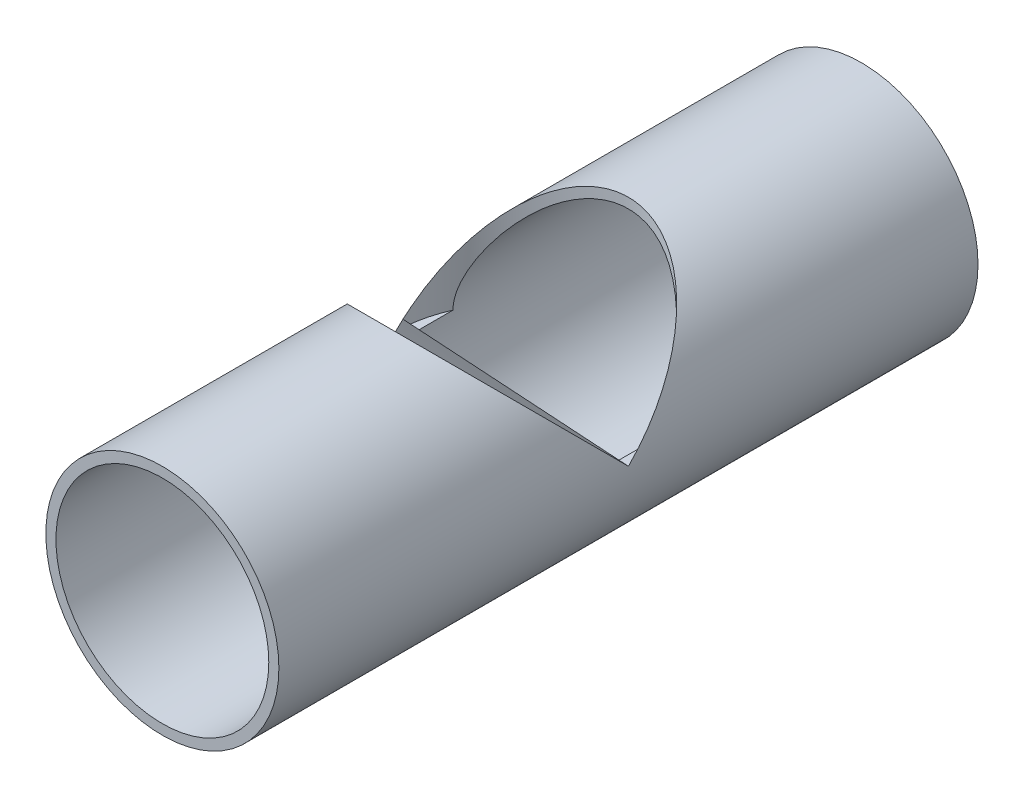
ISO-10303-21;
HEADER;
FILE_DESCRIPTION(('STEP AP214'),'2;1');
FILE_NAME('part.step','',(''),(''),'','','');
FILE_SCHEMA(('AUTOMOTIVE_DESIGN { 1 0 10303 214 1 1 1 1 }'));
ENDSEC;
DATA;
#1=APPLICATION_CONTEXT('core data for automotive mechanical design processes');
#2=APPLICATION_PROTOCOL_DEFINITION('international standard','automotive_design',2000,#1);
#3=PRODUCT_CONTEXT('',#1,'mechanical');
#4=PRODUCT('Part','Part','',(#3));
#5=PRODUCT_RELATED_PRODUCT_CATEGORY('part','',(#4));
#6=PRODUCT_DEFINITION_FORMATION('','',#4);
#7=PRODUCT_DEFINITION_CONTEXT('part definition',#1,'design');
#8=PRODUCT_DEFINITION('design','',#6,#7);
#9=PRODUCT_DEFINITION_SHAPE('','',#8);
#10=(LENGTH_UNIT() NAMED_UNIT(*) SI_UNIT(.MILLI.,.METRE.));
#11=(NAMED_UNIT(*) PLANE_ANGLE_UNIT() SI_UNIT($,.RADIAN.));
#12=(NAMED_UNIT(*) SI_UNIT($,.STERADIAN.) SOLID_ANGLE_UNIT());
#13=UNCERTAINTY_MEASURE_WITH_UNIT(LENGTH_MEASURE(1.E-05),#10,'distance_accuracy_value','');
#14=(GEOMETRIC_REPRESENTATION_CONTEXT(3) GLOBAL_UNCERTAINTY_ASSIGNED_CONTEXT((#13)) GLOBAL_UNIT_ASSIGNED_CONTEXT((#10,
#11,#12)) REPRESENTATION_CONTEXT('',''));
#15=CARTESIAN_POINT('',(0.,0.,0.));
#16=DIRECTION('',(0.,0.,1.));
#17=DIRECTION('',(1.,0.,0.));
#18=AXIS2_PLACEMENT_3D('',#15,#16,#17);
#19=CARTESIAN_POINT('',(0.,0.,57.15));
#20=DIRECTION('',(0.,-1.,0.));
#21=DIRECTION('',(0.,0.,-1.));
#22=AXIS2_PLACEMENT_3D('',#19,#20,#21);
#23=PLANE('',#22);
#24=CARTESIAN_POINT('',(0.,0.,57.15));
#25=DIRECTION('',(0.,1.,0.));
#26=DIRECTION('',(0.,0.,1.));
#27=AXIS2_PLACEMENT_3D('',#24,#25,#26);
#28=CIRCLE('',#27,19.05);
#29=CARTESIAN_POINT('',(-17.399,0.,49.3925971485297));
#30=VERTEX_POINT('',#29);
#31=CARTESIAN_POINT('',(-19.05,0.,57.15));
#32=VERTEX_POINT('',#31);
#33=EDGE_CURVE('E33',#30,#32,#28,.T.);
#34=ORIENTED_EDGE('',*,*,#33,.T.);
#35=CARTESIAN_POINT('',(0.,0.,57.15));
#36=DIRECTION('',(0.,1.,0.));
#37=DIRECTION('',(0.,0.,1.));
#38=AXIS2_PLACEMENT_3D('',#35,#36,#37);
#39=CIRCLE('',#38,19.05);
#40=CARTESIAN_POINT('',(-17.399,0.,64.9074028514703));
#41=VERTEX_POINT('',#40);
#42=EDGE_CURVE('E66',#32,#41,#39,.T.);
#43=ORIENTED_EDGE('',*,*,#42,.T.);
#44=DIRECTION('',(0.,0.,1.));
#45=VECTOR('',#44,1.);
#46=CARTESIAN_POINT('',(-17.399,0.,0.));
#47=LINE('',#46,#45);
#48=EDGE_CURVE('E58',#41,#30,#47,.F.);
#49=ORIENTED_EDGE('',*,*,#48,.T.);
#50=EDGE_LOOP('',(#34,#43,#49));
#51=FACE_BOUND('',#50,.T.);
#52=ADVANCED_FACE('F16',(#51),#23,.F.);
#53=CARTESIAN_POINT('',(0.,0.,57.15));
#54=DIRECTION('',(0.,-1.,0.));
#55=DIRECTION('',(0.,0.,-1.));
#56=AXIS2_PLACEMENT_3D('',#53,#54,#55);
#57=PLANE('',#56);
#58=CARTESIAN_POINT('',(0.,0.,57.15));
#59=DIRECTION('',(0.,1.,0.));
#60=DIRECTION('',(0.,0.,1.));
#61=AXIS2_PLACEMENT_3D('',#58,#59,#60);
#62=CIRCLE('',#61,19.05);
#63=CARTESIAN_POINT('',(17.399,0.,64.9074028514703));
#64=VERTEX_POINT('',#63);
#65=CARTESIAN_POINT('',(19.05,0.,57.15));
#66=VERTEX_POINT('',#65);
#67=EDGE_CURVE('E51',#64,#66,#62,.T.);
#68=ORIENTED_EDGE('',*,*,#67,.T.);
#69=CARTESIAN_POINT('',(0.,0.,57.15));
#70=DIRECTION('',(0.,1.,0.));
#71=DIRECTION('',(0.,0.,1.));
#72=AXIS2_PLACEMENT_3D('',#69,#70,#71);
#73=CIRCLE('',#72,19.05);
#74=CARTESIAN_POINT('',(17.399,0.,49.3925971485297));
#75=VERTEX_POINT('',#74);
#76=EDGE_CURVE('E54',#66,#75,#73,.T.);
#77=ORIENTED_EDGE('',*,*,#76,.T.);
#78=DIRECTION('',(0.,0.,1.));
#79=VECTOR('',#78,1.);
#80=CARTESIAN_POINT('',(17.399,0.,0.));
#81=LINE('',#80,#79);
#82=EDGE_CURVE('E47',#75,#64,#81,.T.);
#83=ORIENTED_EDGE('',*,*,#82,.T.);
#84=EDGE_LOOP('',(#68,#77,#83));
#85=FACE_BOUND('',#84,.T.);
#86=ADVANCED_FACE('F49',(#85),#57,.F.);
#87=CARTESIAN_POINT('',(0.,0.,0.));
#88=DIRECTION('',(0.,0.,1.));
#89=DIRECTION('',(1.,0.,0.));
#90=AXIS2_PLACEMENT_3D('',#87,#88,#89);
#91=CYLINDRICAL_SURFACE('',#90,17.399);
#92=CARTESIAN_POINT('',(0.,0.,0.));
#93=DIRECTION('',(0.,0.,1.));
#94=DIRECTION('',(1.,0.,0.));
#95=AXIS2_PLACEMENT_3D('',#92,#93,#94);
#96=CIRCLE('',#95,17.399);
#97=CARTESIAN_POINT('',(17.399,0.,0.));
#98=VERTEX_POINT('',#97);
#99=EDGE_CURVE('E114',#98,#98,#96,.T.);
#100=ORIENTED_EDGE('',*,*,#99,.F.);
#101=EDGE_LOOP('',(#100));
#102=FACE_BOUND('',#101,.T.);
#103=ORIENTED_EDGE('',*,*,#48,.F.);
#104=CARTESIAN_POINT('',(-17.399,0.,64.9074028514703));
#105=CARTESIAN_POINT('',(-17.3990027926557,0.126619411653412,64.9073892806763));
#106=CARTESIAN_POINT('',(-17.3976172953479,0.253213422142252,64.91050481767));
#107=CARTESIAN_POINT('',(-17.3920993093259,0.506011561056938,64.9228663106787));
#108=CARTESIAN_POINT('',(-17.3879674951789,0.632215777580591,64.9321107612707));
#109=CARTESIAN_POINT('',(-17.3715310393773,1.00902330778525,64.9687698671014));
#110=CARTESIAN_POINT('',(-17.3551849725285,1.25863541656879,65.005111937121));
#111=CARTESIAN_POINT('',(-17.3126787054344,1.74803233786395,65.0983443626753));
#112=CARTESIAN_POINT('',(-17.2867118539878,1.98791378893045,65.1548291232535));
#113=CARTESIAN_POINT('',(-17.2256220476168,2.4617617860572,65.2854561488629));
#114=CARTESIAN_POINT('',(-17.1904915826852,2.69572330712606,65.3596128925784));
#115=CARTESIAN_POINT('',(-17.0914704002142,3.27608545997221,65.5644416491115));
#116=CARTESIAN_POINT('',(-17.0220928683165,3.6182148201961,65.7045314532728));
#117=CARTESIAN_POINT('',(-16.8659507450822,4.2875618159471,66.008409139202));
#118=CARTESIAN_POINT('',(-16.7791763237468,4.6147708919803,66.1722104043654));
#119=CARTESIAN_POINT('',(-16.5885907607409,5.25908025866418,66.5180621575718));
#120=CARTESIAN_POINT('',(-16.4846028375362,5.57602990071133,66.7002934483331));
#121=CARTESIAN_POINT('',(-16.2611162606568,6.19761374754541,67.0760481170756));
#122=CARTESIAN_POINT('',(-16.1416117153161,6.50224321644266,67.2695757688457));
#123=CARTESIAN_POINT('',(-15.9012328343761,7.0682446326165,67.6427199440383));
#124=CARTESIAN_POINT('',(-15.7818795075659,7.33075234639333,67.8216028930283));
#125=CARTESIAN_POINT('',(-15.531375280231,7.84755054304734,68.1830066315397));
#126=CARTESIAN_POINT('',(-15.4002228366692,8.10183994524195,68.3655278944272));
#127=CARTESIAN_POINT('',(-15.1261173325553,8.60275103720113,68.7325543909568));
#128=CARTESIAN_POINT('',(-14.9831580377589,8.84936858024162,68.9170606274058));
#129=CARTESIAN_POINT('',(-14.6854749405307,9.33504840785214,69.2865419716062));
#130=CARTESIAN_POINT('',(-14.5307500246226,9.57410997430043,69.4715171221294));
#131=CARTESIAN_POINT('',(-14.0499414824725,10.2784757466186,70.023976753931));
#132=CARTESIAN_POINT('',(-13.706221982577,10.7327911450247,70.3903569500405));
#133=CARTESIAN_POINT('',(-12.9709988366539,11.6105902831832,71.1114056628348));
#134=CARTESIAN_POINT('',(-12.5795204493307,12.0340901330639,71.4660802453506));
#135=CARTESIAN_POINT('',(-11.8513027830295,12.7460780346226,72.0702493412787));
#136=CARTESIAN_POINT('',(-11.5252152004648,13.0419213680792,72.32393857843));
#137=CARTESIAN_POINT('',(-10.8451357651757,13.6126880208168,72.8172254345686));
#138=CARTESIAN_POINT('',(-10.4911442114866,13.8876115642246,73.0568232045201));
#139=CARTESIAN_POINT('',(-9.7556464324253,14.4137713143204,73.5182053590736));
#140=CARTESIAN_POINT('',(-9.37416774185507,14.6650306596365,73.7400071123435));
#141=CARTESIAN_POINT('',(-8.58390774378864,15.1411487148883,74.1623369264844));
#142=CARTESIAN_POINT('',(-8.17513251731963,15.3660132743823,74.3628696999896));
#143=CARTESIAN_POINT('',(-7.41609675759786,15.7438449488538,74.7010787980119));
#144=CARTESIAN_POINT('',(-7.07052907343838,15.9021892450143,74.8432976749746));
#145=CARTESIAN_POINT('',(-6.36382451687045,16.1979501260028,75.1095864108884));
#146=CARTESIAN_POINT('',(-6.00269106933714,16.3353712846128,75.2336602360993));
#147=CARTESIAN_POINT('',(-5.26647789377184,16.5873660705375,75.4616118596446));
#148=CARTESIAN_POINT('',(-4.89140366751787,16.7019485999545,75.5654975265765));
#149=CARTESIAN_POINT('',(-4.12923028647436,16.9065171053999,75.751230625274));
#150=CARTESIAN_POINT('',(-3.74213100127715,16.9965028145804,75.8330778179467));
#151=CARTESIAN_POINT('',(-2.95593537190508,17.1507769807365,75.9735337773239));
#152=CARTESIAN_POINT('',(-2.55677683000924,17.2148923872178,76.0319860313285));
#153=CARTESIAN_POINT('',(-1.75207798329658,17.3153056168189,76.1235785556383));
#154=CARTESIAN_POINT('',(-1.34653766138736,17.3516033654214,76.1567187581382));
#155=CARTESIAN_POINT('',(-0.532740871466237,17.3956140232931,76.1969054092446));
#156=CARTESIAN_POINT('',(-0.124485289769641,17.4033358417348,76.2039599906146));
#157=CARTESIAN_POINT('',(0.691145635542898,17.3900500247943,76.1918258138202));
#158=CARTESIAN_POINT('',(1.09852104488591,17.3690446145166,76.17263908821));
#159=CARTESIAN_POINT('',(1.86650740664488,17.3024305274246,76.1118364386318));
#160=CARTESIAN_POINT('',(2.22756908470294,17.2596128163397,76.0727652631555));
#161=CARTESIAN_POINT('',(2.94361664813322,17.1520079260685,75.9746695916722));
#162=CARTESIAN_POINT('',(3.2986030444039,17.0872226038712,75.9156467822389));
#163=CARTESIAN_POINT('',(4.00038341779028,16.9366748894927,75.7786682489914));
#164=CARTESIAN_POINT('',(4.34717668373007,16.8509106835957,75.700710888207));
#165=CARTESIAN_POINT('',(5.03073264287059,16.65961931318,75.5271216594109));
#166=CARTESIAN_POINT('',(5.36749474073483,16.5540909783843,75.4314887447959));
#167=CARTESIAN_POINT('',(6.04508836894759,16.319211609248,75.2190712727942));
#168=CARTESIAN_POINT('',(6.38536566225002,16.1889732182397,75.1015031398445));
#169=CARTESIAN_POINT('',(7.05200979717744,15.9099012910429,74.8502421296737));
#170=CARTESIAN_POINT('',(7.37837661185775,15.7610677188377,74.7165492212207));
#171=CARTESIAN_POINT('',(8.01637955747604,15.4463398391999,74.4347274052077));
#172=CARTESIAN_POINT('',(8.32801263159099,15.2804420139058,74.2865955213283));
#173=CARTESIAN_POINT('',(8.93593865373799,14.9330779736276,73.9775912941988));
#174=CARTESIAN_POINT('',(9.23222831724047,14.751608447154,73.8167162415391));
#175=CARTESIAN_POINT('',(9.96108070114769,14.2751141336036,73.39616265681));
#176=CARTESIAN_POINT('',(10.3832304302346,13.9706188807904,73.1290705087056));
#177=CARTESIAN_POINT('',(11.1906483352997,13.3326512383542,72.5743967388524));
#178=CARTESIAN_POINT('',(11.5758996118658,12.9991657033674,72.2868058328948));
#179=CARTESIAN_POINT('',(12.3107246973626,12.3055766392129,71.6954983316236));
#180=CARTESIAN_POINT('',(12.6601983724747,11.9454030182208,71.3917399093147));
#181=CARTESIAN_POINT('',(13.3228256699068,11.2015895641249,70.7738744147983));
#182=CARTESIAN_POINT('',(13.6359864105728,10.8179543527437,70.4597693863683));
#183=CARTESIAN_POINT('',(14.2338486111263,10.0188698517803,69.8187294700677));
#184=CARTESIAN_POINT('',(14.517686463156,9.60287793519724,69.4916676006417));
#185=CARTESIAN_POINT('',(15.0487827113267,8.74718214020968,68.838186754623));
#186=CARTESIAN_POINT('',(15.296023432836,8.30746694358544,68.5117681633014));
#187=CARTESIAN_POINT('',(15.6391176739874,7.6293606590487,68.0293160856903));
#188=CARTESIAN_POINT('',(15.7488029782035,7.40036468575161,67.869778727444));
#189=CARTESIAN_POINT('',(15.9589029321096,6.9356804418858,67.5544108647403));
#190=CARTESIAN_POINT('',(16.0593187405627,6.69999301263363,67.3985798987662));
#191=CARTESIAN_POINT('',(16.25064002581,6.22159236078595,67.0924221698046));
#192=CARTESIAN_POINT('',(16.3415534376162,5.97888521981352,66.9420908835962));
#193=CARTESIAN_POINT('',(16.5136633013956,5.48564865833397,66.6489623035712));
#194=CARTESIAN_POINT('',(16.5948621460068,5.23512118317328,66.5061631594989));
#195=CARTESIAN_POINT('',(16.7399044598348,4.74960595279282,66.2438654480011));
#196=CARTESIAN_POINT('',(16.8046633839798,4.51539494834859,66.1234411407302));
#197=CARTESIAN_POINT('',(16.9253972886873,4.03935876063698,65.8935847674936));
#198=CARTESIAN_POINT('',(16.981371807116,3.79753317758156,65.784153279952));
#199=CARTESIAN_POINT('',(17.0835577011958,3.30749209621931,65.5801538563993));
#200=CARTESIAN_POINT('',(17.1298288043977,3.05932691299981,65.4854959663158));
#201=CARTESIAN_POINT('',(17.2122316312634,2.55526916443492,65.3139853899444));
#202=CARTESIAN_POINT('',(17.2483680118588,2.29938020825195,65.2371245287159));
#203=CARTESIAN_POINT('',(17.2984619179857,1.87510757973664,65.1292141352051));
#204=CARTESIAN_POINT('',(17.3157056836072,1.70875077851934,65.0916704239793));
#205=CARTESIAN_POINT('',(17.3454986249527,1.37373521286453,65.0263862190104));
#206=CARTESIAN_POINT('',(17.35804919276,1.20507714643118,64.9986428184619));
#207=CARTESIAN_POINT('',(17.3783689967595,0.86423619591593,64.9535535854909));
#208=CARTESIAN_POINT('',(17.386085725966,0.692034904492633,64.9363219871161));
#209=CARTESIAN_POINT('',(17.3964114605965,0.34656692612635,64.9132082062703));
#210=CARTESIAN_POINT('',(17.3990157927525,0.173299409508221,64.9073364079205));
#211=CARTESIAN_POINT('',(17.399,0.,64.9074028514704));
#212=B_SPLINE_CURVE_WITH_KNOTS('',3,(#104,#105,#106,#107,#108,#109,#110,#111,#112,#113,#114,
#115,#116,#117,#118,#119,#120,#121,#122,#123,#124,#125,#126,#127,#128,#129,#130,#131,#132,#133,
#134,#135,#136,#137,#138,#139,#140,#141,#142,#143,#144,#145,#146,#147,#148,#149,#150,#151,#152,
#153,#154,#155,#156,#157,#158,#159,#160,#161,#162,#163,#164,#165,#166,#167,#168,#169,#170,#171,
#172,#173,#174,#175,#176,#177,#178,#179,#180,#181,#182,#183,#184,#185,#186,#187,#188,#189,#190,
#191,#192,#193,#194,#195,#196,#197,#198,#199,#200,#201,#202,#203,#204,#205,#206,#207,#208,#209,
#210,#211),.UNSPECIFIED.,.F.,.F.,(4,2,2,2,2,2,2,2,2,2,2,2,2,2,2,2,2,2,2,2,2,2,2,2,2,2,2,2,2,2,2,
2,2,2,2,2,2,2,2,2,2,2,2,2,2,2,2,2,2,2,2,2,2,4),(0.,0.379764092853833,0.759434940165909,
1.51634726991587,2.25880724087371,3.00187761458816,4.12835037763912,5.25546144985719,
6.3949616034871,7.53489569789875,8.55259337985784,9.57042434587642,10.5887962249633,
11.6072646010801,13.6367495933949,15.6651658480776,17.1883664070907,18.71155064481,
20.2332297195439,21.754570923617,22.9709961355442,24.187155054878,25.4028390055058,
26.6185361444175,27.8422355786928,29.0659382909752,30.2892594549617,31.5124858703965,
32.608284333679,33.7039901888642,34.7997908060849,35.8956563285599,37.043090764153,
38.1905274222329,39.3382011047017,40.4861194600479,42.2386035757021,43.991886525206,
45.749949583538,47.5076674278728,49.3075787665061,51.1083565581974,52.0077767250255,
52.9070843042516,53.8056348105301,54.7039635517724,55.5171752742101,56.3304297641096,
57.1385211097759,57.9462405247013,58.4601584642904,58.9739238458356,59.4931773421597,
60.0129052701034),.UNSPECIFIED.);
#213=EDGE_CURVE('E62',#41,#64,#212,.T.);
#214=ORIENTED_EDGE('',*,*,#213,.T.);
#215=ORIENTED_EDGE('',*,*,#82,.F.);
#216=CARTESIAN_POINT('',(17.399,0.,49.3925971485297));
#217=CARTESIAN_POINT('',(17.3990027926557,0.12661941165341,49.3926107193237));
#218=CARTESIAN_POINT('',(17.3976172953479,0.25321342214225,49.38949518233));
#219=CARTESIAN_POINT('',(17.3920993093259,0.506011561056936,49.3771336893213));
#220=CARTESIAN_POINT('',(17.3879674951789,0.632215777580588,49.3678892387293));
#221=CARTESIAN_POINT('',(17.3715310393773,1.00902330778525,49.3312301328986));
#222=CARTESIAN_POINT('',(17.3551849725285,1.25863541656879,49.294888062879));
#223=CARTESIAN_POINT('',(17.3126787054344,1.74803233786395,49.2016556373247));
#224=CARTESIAN_POINT('',(17.2867118539878,1.98791378893046,49.1451708767465));
#225=CARTESIAN_POINT('',(17.2256220476168,2.4617617860572,49.0145438511371));
#226=CARTESIAN_POINT('',(17.1904915826852,2.69572330712607,48.9403871074216));
#227=CARTESIAN_POINT('',(17.0914704002142,3.2760854599722,48.7355583508885));
#228=CARTESIAN_POINT('',(17.0220928683165,3.6182148201961,48.5954685467272));
#229=CARTESIAN_POINT('',(16.8659507450822,4.28756181594711,48.291590860798));
#230=CARTESIAN_POINT('',(16.7791763237468,4.6147708919803,48.1277895956346));
#231=CARTESIAN_POINT('',(16.5885907607409,5.25908025866418,47.7819378424282));
#232=CARTESIAN_POINT('',(16.4846028375362,5.57602990071133,47.5997065516669));
#233=CARTESIAN_POINT('',(16.2611162606568,6.19761374754541,47.2239518829244));
#234=CARTESIAN_POINT('',(16.1416117153161,6.50224321644265,47.0304242311543));
#235=CARTESIAN_POINT('',(15.9012328343761,7.06824463261649,46.6572800559617));
#236=CARTESIAN_POINT('',(15.7818795075659,7.33075234639333,46.4783971069717));
#237=CARTESIAN_POINT('',(15.531375280231,7.84755054304734,46.1169933684603));
#238=CARTESIAN_POINT('',(15.4002228366692,8.10183994524193,45.9344721055728));
#239=CARTESIAN_POINT('',(15.1261173325553,8.60275103720112,45.5674456090432));
#240=CARTESIAN_POINT('',(14.9831580377589,8.84936858024161,45.3829393725942));
#241=CARTESIAN_POINT('',(14.6854749405307,9.33504840785213,45.0134580283939));
#242=CARTESIAN_POINT('',(14.5307500246226,9.57410997430042,44.8284828778707));
#243=CARTESIAN_POINT('',(14.0499414824725,10.2784757466186,44.276023246069));
#244=CARTESIAN_POINT('',(13.706221982577,10.7327911450247,43.9096430499595));
#245=CARTESIAN_POINT('',(12.9709988366539,11.6105902831832,43.1885943371652));
#246=CARTESIAN_POINT('',(12.5795204493307,12.0340901330639,42.8339197546494));
#247=CARTESIAN_POINT('',(11.8513027830295,12.7460780346226,42.2297506587214));
#248=CARTESIAN_POINT('',(11.5252152004648,13.0419213680792,41.97606142157));
#249=CARTESIAN_POINT('',(10.8451357651757,13.6126880208168,41.4827745654314));
#250=CARTESIAN_POINT('',(10.4911442114866,13.8876115642246,41.2431767954799));
#251=CARTESIAN_POINT('',(9.7556464324253,14.4137713143204,40.7817946409264));
#252=CARTESIAN_POINT('',(9.37416774185507,14.6650306596365,40.5599928876565));
#253=CARTESIAN_POINT('',(8.58390774378864,15.1411487148883,40.1376630735156));
#254=CARTESIAN_POINT('',(8.17513251731962,15.3660132743823,39.9371303000104));
#255=CARTESIAN_POINT('',(7.41609675759786,15.7438449488538,39.5989212019881));
#256=CARTESIAN_POINT('',(7.07052907343837,15.9021892450143,39.4567023250254));
#257=CARTESIAN_POINT('',(6.36382451687044,16.1979501260028,39.1904135891116));
#258=CARTESIAN_POINT('',(6.00269106933713,16.3353712846128,39.0663397639007));
#259=CARTESIAN_POINT('',(5.26647789377183,16.5873660705375,38.8383881403555));
#260=CARTESIAN_POINT('',(4.89140366751786,16.7019485999545,38.7345024734235));
#261=CARTESIAN_POINT('',(4.12923028647435,16.9065171053999,38.548769374726));
#262=CARTESIAN_POINT('',(3.74213100127715,16.9965028145804,38.4669221820533));
#263=CARTESIAN_POINT('',(2.95593537190507,17.1507769807365,38.3264662226761));
#264=CARTESIAN_POINT('',(2.55677683000923,17.2148923872178,38.2680139686715));
#265=CARTESIAN_POINT('',(1.75207798329657,17.3153056168189,38.1764214443617));
#266=CARTESIAN_POINT('',(1.34653766138735,17.3516033654214,38.1432812418618));
#267=CARTESIAN_POINT('',(0.532740871466227,17.3956140232931,38.1030945907555));
#268=CARTESIAN_POINT('',(0.124485289769633,17.4033358417348,38.0960400093854));
#269=CARTESIAN_POINT('',(-0.691145635542906,17.3900500247943,38.1081741861798));
#270=CARTESIAN_POINT('',(-1.09852104488592,17.3690446145166,38.12736091179));
#271=CARTESIAN_POINT('',(-1.86650740664489,17.3024305274246,38.1881635613682));
#272=CARTESIAN_POINT('',(-2.22756908470294,17.2596128163397,38.2272347368446));
#273=CARTESIAN_POINT('',(-2.94361664813322,17.1520079260685,38.3253304083278));
#274=CARTESIAN_POINT('',(-3.2986030444039,17.0872226038712,38.3843532177611));
#275=CARTESIAN_POINT('',(-4.00038341779028,16.9366748894927,38.5213317510087));
#276=CARTESIAN_POINT('',(-4.34717668373008,16.8509106835957,38.5992891117931));
#277=CARTESIAN_POINT('',(-5.0307326428706,16.65961931318,38.7728783405891));
#278=CARTESIAN_POINT('',(-5.36749474073484,16.5540909783843,38.8685112552042));
#279=CARTESIAN_POINT('',(-6.04508836894759,16.319211609248,39.0809287272059));
#280=CARTESIAN_POINT('',(-6.38536566225003,16.1889732182396,39.1984968601555));
#281=CARTESIAN_POINT('',(-7.05200979717745,15.9099012910429,39.4497578703263));
#282=CARTESIAN_POINT('',(-7.37837661185776,15.7610677188377,39.5834507787793));
#283=CARTESIAN_POINT('',(-8.01637955747605,15.4463398391999,39.8652725947923));
#284=CARTESIAN_POINT('',(-8.32801263159099,15.2804420139058,40.0134044786717));
#285=CARTESIAN_POINT('',(-8.93593865373799,14.9330779736276,40.3224087058013));
#286=CARTESIAN_POINT('',(-9.23222831724047,14.751608447154,40.4832837584609));
#287=CARTESIAN_POINT('',(-9.9610807011477,14.2751141336036,40.90383734319));
#288=CARTESIAN_POINT('',(-10.3832304302346,13.9706188807904,41.1709294912944));
#289=CARTESIAN_POINT('',(-11.1906483352997,13.3326512383542,41.7256032611476));
#290=CARTESIAN_POINT('',(-11.5758996118658,12.9991657033674,42.0131941671052));
#291=CARTESIAN_POINT('',(-12.3107246973626,12.3055766392129,42.6045016683764));
#292=CARTESIAN_POINT('',(-12.6601983724747,11.9454030182208,42.9082600906854));
#293=CARTESIAN_POINT('',(-13.3228256699068,11.2015895641249,43.5261255852017));
#294=CARTESIAN_POINT('',(-13.6359864105728,10.8179543527437,43.8402306136318));
#295=CARTESIAN_POINT('',(-14.2338486111263,10.0188698517803,44.4812705299324));
#296=CARTESIAN_POINT('',(-14.517686463156,9.60287793519723,44.8083323993583));
#297=CARTESIAN_POINT('',(-15.0487827113267,8.74718214020968,45.461813245377));
#298=CARTESIAN_POINT('',(-15.296023432836,8.30746694358544,45.7882318366987));
#299=CARTESIAN_POINT('',(-15.6391176739874,7.6293606590487,46.2706839143097));
#300=CARTESIAN_POINT('',(-15.7488029782035,7.40036468575161,46.430221272556));
#301=CARTESIAN_POINT('',(-15.9589029321096,6.93568044188581,46.7455891352597));
#302=CARTESIAN_POINT('',(-16.0593187405627,6.69999301263364,46.9014201012338));
#303=CARTESIAN_POINT('',(-16.25064002581,6.22159236078596,47.2075778301954));
#304=CARTESIAN_POINT('',(-16.3415534376162,5.97888521981353,47.3579091164038));
#305=CARTESIAN_POINT('',(-16.5136633013956,5.48564865833398,47.6510376964288));
#306=CARTESIAN_POINT('',(-16.5948621460068,5.23512118317328,47.7938368405011));
#307=CARTESIAN_POINT('',(-16.7399044598348,4.74960595279281,48.0561345519989));
#308=CARTESIAN_POINT('',(-16.8046633839798,4.51539494834858,48.1765588592699));
#309=CARTESIAN_POINT('',(-16.9253972886873,4.03935876063698,48.4064152325064));
#310=CARTESIAN_POINT('',(-16.981371807116,3.79753317758156,48.515846720048));
#311=CARTESIAN_POINT('',(-17.0835577011958,3.30749209621931,48.7198461436007));
#312=CARTESIAN_POINT('',(-17.1298288043977,3.05932691299981,48.8145040336842));
#313=CARTESIAN_POINT('',(-17.2122316312634,2.55526916443492,48.9860146100556));
#314=CARTESIAN_POINT('',(-17.2483680118588,2.29938020825194,49.0628754712841));
#315=CARTESIAN_POINT('',(-17.2984619179858,1.87510757973663,49.1707858647949));
#316=CARTESIAN_POINT('',(-17.3157056836072,1.70875077851933,49.2083295760207));
#317=CARTESIAN_POINT('',(-17.3454986249527,1.37373521286453,49.2736137809896));
#318=CARTESIAN_POINT('',(-17.35804919276,1.20507714643118,49.3013571815381));
#319=CARTESIAN_POINT('',(-17.3783689967595,0.864236195915931,49.3464464145092));
#320=CARTESIAN_POINT('',(-17.386085725966,0.692034904492635,49.3636780128839));
#321=CARTESIAN_POINT('',(-17.3964114605965,0.346566926126353,49.3867917937297));
#322=CARTESIAN_POINT('',(-17.3990157927525,0.173299409508221,49.3926635920795));
#323=CARTESIAN_POINT('',(-17.399,0.,49.3925971485297));
#324=B_SPLINE_CURVE_WITH_KNOTS('',3,(#216,#217,#218,#219,#220,#221,#222,#223,#224,#225,#226,
#227,#228,#229,#230,#231,#232,#233,#234,#235,#236,#237,#238,#239,#240,#241,#242,#243,#244,#245,
#246,#247,#248,#249,#250,#251,#252,#253,#254,#255,#256,#257,#258,#259,#260,#261,#262,#263,#264,
#265,#266,#267,#268,#269,#270,#271,#272,#273,#274,#275,#276,#277,#278,#279,#280,#281,#282,#283,
#284,#285,#286,#287,#288,#289,#290,#291,#292,#293,#294,#295,#296,#297,#298,#299,#300,#301,#302,
#303,#304,#305,#306,#307,#308,#309,#310,#311,#312,#313,#314,#315,#316,#317,#318,#319,#320,#321,
#322,#323),.UNSPECIFIED.,.F.,.F.,(4,2,2,2,2,2,2,2,2,2,2,2,2,2,2,2,2,2,2,2,2,2,2,2,2,2,2,2,2,2,2,
2,2,2,2,2,2,2,2,2,2,2,2,2,2,2,2,2,2,2,2,2,2,4),(0.,0.379764092853832,0.759434940165908,
1.51634726991587,2.25880724087371,3.00187761458816,4.12835037763912,5.25546144985719,
6.39496160348711,7.53489569789875,8.55259337985783,9.57042434587641,10.5887962249633,
11.6072646010801,13.6367495933949,15.6651658480776,17.1883664070907,18.71155064481,
20.2332297195439,21.754570923617,22.9709961355442,24.187155054878,25.4028390055058,
26.6185361444175,27.8422355786928,29.0659382909752,30.2892594549617,31.5124858703965,
32.608284333679,33.7039901888642,34.7997908060849,35.8956563285599,37.043090764153,
38.1905274222329,39.3382011047017,40.4861194600479,42.2386035757021,43.991886525206,
45.749949583538,47.5076674278728,49.3075787665061,51.1083565581975,52.0077767250255,
52.9070843042516,53.8056348105302,54.7039635517725,55.5171752742101,56.3304297641096,
57.1385211097759,57.9462405247014,58.4601584642904,58.9739238458356,59.4931773421598,
60.0129052701035),.UNSPECIFIED.);
#325=EDGE_CURVE('E118',#75,#30,#324,.T.);
#326=ORIENTED_EDGE('',*,*,#325,.T.);
#327=EDGE_LOOP('',(#103,#214,#215,#326));
#328=FACE_BOUND('',#327,.T.);
#329=CARTESIAN_POINT('',(0.,0.,114.3));
#330=DIRECTION('',(0.,0.,1.));
#331=DIRECTION('',(1.,0.,0.));
#332=AXIS2_PLACEMENT_3D('',#329,#330,#331);
#333=CIRCLE('',#332,17.399);
#334=CARTESIAN_POINT('',(17.399,0.,114.3));
#335=VERTEX_POINT('',#334);
#336=EDGE_CURVE('E19',#335,#335,#333,.T.);
#337=ORIENTED_EDGE('',*,*,#336,.T.);
#338=EDGE_LOOP('',(#337));
#339=FACE_BOUND('',#338,.T.);
#340=ADVANCED_FACE('F63',(#102,#328,#339),#91,.F.);
#341=CARTESIAN_POINT('',(0.,0.,114.3));
#342=DIRECTION('',(0.,0.,-1.));
#343=DIRECTION('',(-1.,0.,0.));
#344=AXIS2_PLACEMENT_3D('',#341,#342,#343);
#345=PLANE('',#344);
#346=ORIENTED_EDGE('',*,*,#336,.F.);
#347=EDGE_LOOP('',(#346));
#348=FACE_BOUND('',#347,.T.);
#349=CARTESIAN_POINT('',(0.,0.,114.3));
#350=DIRECTION('',(0.,0.,1.));
#351=DIRECTION('',(1.,0.,0.));
#352=AXIS2_PLACEMENT_3D('',#349,#350,#351);
#353=CIRCLE('',#352,19.05);
#354=CARTESIAN_POINT('',(19.05,0.,114.3));
#355=VERTEX_POINT('',#354);
#356=EDGE_CURVE('E113',#355,#355,#353,.F.);
#357=ORIENTED_EDGE('',*,*,#356,.F.);
#358=EDGE_LOOP('',(#357));
#359=FACE_BOUND('',#358,.T.);
#360=ADVANCED_FACE('F86',(#348,#359),#345,.F.);
#361=CARTESIAN_POINT('',(0.,0.,57.15));
#362=DIRECTION('',(0.,1.,0.));
#363=DIRECTION('',(0.,0.,1.));
#364=AXIS2_PLACEMENT_3D('',#361,#362,#363);
#365=CYLINDRICAL_SURFACE('',#364,19.05);
#366=ORIENTED_EDGE('',*,*,#42,.F.);
#367=CARTESIAN_POINT('',(0.,0.,57.15));
#368=DIRECTION('',(0.,-0.707106781186547,0.707106781186547));
#369=DIRECTION('',(0.,0.707106781186547,0.707106781186547));
#370=AXIS2_PLACEMENT_3D('',#367,#368,#369);
#371=ELLIPSE('',#370,26.9407683632075,19.05);
#372=EDGE_CURVE('E70',#66,#32,#371,.T.);
#373=ORIENTED_EDGE('',*,*,#372,.F.);
#374=ORIENTED_EDGE('',*,*,#67,.F.);
#375=ORIENTED_EDGE('',*,*,#213,.F.);
#376=EDGE_LOOP('',(#366,#373,#374,#375));
#377=FACE_BOUND('',#376,.T.);
#378=ADVANCED_FACE('F68',(#377),#365,.F.);
#379=CARTESIAN_POINT('',(0.,0.,57.15));
#380=DIRECTION('',(0.,1.,0.));
#381=DIRECTION('',(0.,0.,1.));
#382=AXIS2_PLACEMENT_3D('',#379,#380,#381);
#383=CYLINDRICAL_SURFACE('',#382,19.05);
#384=ORIENTED_EDGE('',*,*,#76,.F.);
#385=CARTESIAN_POINT('',(0.,0.,57.15));
#386=DIRECTION('',(0.,0.707106781186547,0.707106781186547));
#387=DIRECTION('',(0.,0.707106781186547,-0.707106781186547));
#388=AXIS2_PLACEMENT_3D('',#385,#386,#387);
#389=ELLIPSE('',#388,26.9407683632075,19.05);
#390=EDGE_CURVE('E25',#32,#66,#389,.F.);
#391=ORIENTED_EDGE('',*,*,#390,.F.);
#392=ORIENTED_EDGE('',*,*,#33,.F.);
#393=ORIENTED_EDGE('',*,*,#325,.F.);
#394=EDGE_LOOP('',(#384,#391,#392,#393));
#395=FACE_BOUND('',#394,.T.);
#396=ADVANCED_FACE('F85',(#395),#383,.F.);
#397=CARTESIAN_POINT('',(0.,0.,0.));
#398=DIRECTION('',(0.,0.,-1.));
#399=DIRECTION('',(-1.,0.,0.));
#400=AXIS2_PLACEMENT_3D('',#397,#398,#399);
#401=PLANE('',#400);
#402=ORIENTED_EDGE('',*,*,#99,.T.);
#403=EDGE_LOOP('',(#402));
#404=FACE_BOUND('',#403,.T.);
#405=CARTESIAN_POINT('',(0.,0.,0.));
#406=DIRECTION('',(0.,0.,1.));
#407=DIRECTION('',(1.,0.,0.));
#408=AXIS2_PLACEMENT_3D('',#405,#406,#407);
#409=CIRCLE('',#408,19.05);
#410=CARTESIAN_POINT('',(19.05,0.,0.));
#411=VERTEX_POINT('',#410);
#412=EDGE_CURVE('E11',#411,#411,#409,.T.);
#413=ORIENTED_EDGE('',*,*,#412,.F.);
#414=EDGE_LOOP('',(#413));
#415=FACE_BOUND('',#414,.T.);
#416=ADVANCED_FACE('F100',(#404,#415),#401,.T.);
#417=CARTESIAN_POINT('',(0.,0.,0.));
#418=DIRECTION('',(0.,0.,1.));
#419=DIRECTION('',(1.,0.,0.));
#420=AXIS2_PLACEMENT_3D('',#417,#418,#419);
#421=CYLINDRICAL_SURFACE('',#420,19.05);
#422=ORIENTED_EDGE('',*,*,#412,.T.);
#423=EDGE_LOOP('',(#422));
#424=FACE_BOUND('',#423,.T.);
#425=ORIENTED_EDGE('',*,*,#372,.T.);
#426=ORIENTED_EDGE('',*,*,#390,.T.);
#427=EDGE_LOOP('',(#425,#426));
#428=FACE_BOUND('',#427,.T.);
#429=ORIENTED_EDGE('',*,*,#356,.T.);
#430=EDGE_LOOP('',(#429));
#431=FACE_BOUND('',#430,.T.);
#432=ADVANCED_FACE('F98',(#424,#428,#431),#421,.T.);
#433=CLOSED_SHELL('',(#52,#86,#340,#360,#378,#396,#416,#432));
#434=MANIFOLD_SOLID_BREP('B1',#433);
#435=ADVANCED_BREP_SHAPE_REPRESENTATION('',(#18,#434),#14);
#436=SHAPE_DEFINITION_REPRESENTATION(#9,#435);
ENDSEC;
END-ISO-10303-21;
